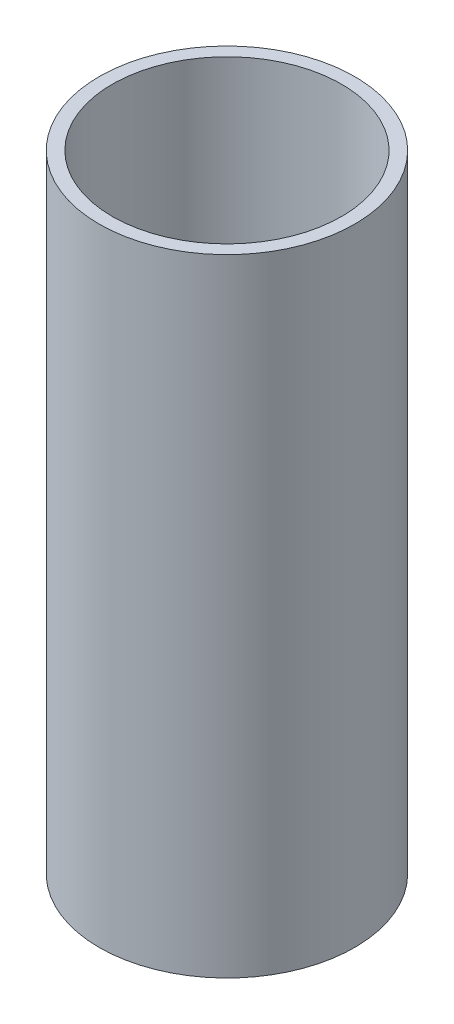
ISO-10303-21;
HEADER;
FILE_DESCRIPTION(('STEP AP214'),'2;1');
FILE_NAME('part.step','',(''),(''),'','','');
FILE_SCHEMA(('AUTOMOTIVE_DESIGN { 1 0 10303 214 1 1 1 1 }'));
ENDSEC;
DATA;
#1=APPLICATION_CONTEXT('core data for automotive mechanical design processes');
#2=APPLICATION_PROTOCOL_DEFINITION('international standard','automotive_design',2000,#1);
#3=PRODUCT_CONTEXT('',#1,'mechanical');
#4=PRODUCT('Part','Part','',(#3));
#5=PRODUCT_RELATED_PRODUCT_CATEGORY('part','',(#4));
#6=PRODUCT_DEFINITION_FORMATION('','',#4);
#7=PRODUCT_DEFINITION_CONTEXT('part definition',#1,'design');
#8=PRODUCT_DEFINITION('design','',#6,#7);
#9=PRODUCT_DEFINITION_SHAPE('','',#8);
#10=(LENGTH_UNIT() NAMED_UNIT(*) SI_UNIT(.MILLI.,.METRE.));
#11=(NAMED_UNIT(*) PLANE_ANGLE_UNIT() SI_UNIT($,.RADIAN.));
#12=(NAMED_UNIT(*) SI_UNIT($,.STERADIAN.) SOLID_ANGLE_UNIT());
#13=UNCERTAINTY_MEASURE_WITH_UNIT(LENGTH_MEASURE(1.E-05),#10,'distance_accuracy_value','');
#14=(GEOMETRIC_REPRESENTATION_CONTEXT(3) GLOBAL_UNCERTAINTY_ASSIGNED_CONTEXT((#13)) GLOBAL_UNIT_ASSIGNED_CONTEXT((#10,
#11,#12)) REPRESENTATION_CONTEXT('',''));
#15=CARTESIAN_POINT('',(0.,0.,0.));
#16=DIRECTION('',(0.,0.,1.));
#17=DIRECTION('',(1.,0.,0.));
#18=AXIS2_PLACEMENT_3D('',#15,#16,#17);
#19=CARTESIAN_POINT('',(0.,196.098768280488,0.));
#20=DIRECTION('',(0.,-1.,0.));
#21=DIRECTION('',(0.,0.,-1.));
#22=AXIS2_PLACEMENT_3D('',#19,#20,#21);
#23=CYLINDRICAL_SURFACE('',#22,40.);
#24=CARTESIAN_POINT('',(0.,196.098768280488,0.));
#25=DIRECTION('',(0.,1.,0.));
#26=DIRECTION('',(0.,0.,1.));
#27=AXIS2_PLACEMENT_3D('',#24,#25,#26);
#28=CIRCLE('',#27,40.);
#29=CARTESIAN_POINT('',(0.,196.098768280488,40.));
#30=VERTEX_POINT('',#29);
#31=EDGE_CURVE('E10',#30,#30,#28,.T.);
#32=ORIENTED_EDGE('',*,*,#31,.F.);
#33=EDGE_LOOP('',(#32));
#34=FACE_BOUND('',#33,.T.);
#35=CARTESIAN_POINT('',(0.,0.,0.));
#36=DIRECTION('',(0.,1.,0.));
#37=DIRECTION('',(0.,0.,1.));
#38=AXIS2_PLACEMENT_3D('',#35,#36,#37);
#39=CIRCLE('',#38,40.);
#40=CARTESIAN_POINT('',(0.,0.,40.));
#41=VERTEX_POINT('',#40);
#42=EDGE_CURVE('E37',#41,#41,#39,.T.);
#43=ORIENTED_EDGE('',*,*,#42,.T.);
#44=EDGE_LOOP('',(#43));
#45=FACE_BOUND('',#44,.T.);
#46=ADVANCED_FACE('F40',(#34,#45),#23,.T.);
#47=CARTESIAN_POINT('',(0.,196.098768280488,0.));
#48=DIRECTION('',(0.,1.,0.));
#49=DIRECTION('',(0.,0.,1.));
#50=AXIS2_PLACEMENT_3D('',#47,#48,#49);
#51=PLANE('',#50);
#52=CARTESIAN_POINT('',(0.,196.098768280488,0.));
#53=DIRECTION('',(0.,1.,0.));
#54=DIRECTION('',(0.,0.,1.));
#55=AXIS2_PLACEMENT_3D('',#52,#53,#54);
#56=CIRCLE('',#55,35.885008553083);
#57=CARTESIAN_POINT('',(0.,196.098768280488,35.885008553083));
#58=VERTEX_POINT('',#57);
#59=EDGE_CURVE('E50',#58,#58,#56,.T.);
#60=ORIENTED_EDGE('',*,*,#59,.F.);
#61=EDGE_LOOP('',(#60));
#62=FACE_BOUND('',#61,.T.);
#63=ORIENTED_EDGE('',*,*,#31,.T.);
#64=EDGE_LOOP('',(#63));
#65=FACE_BOUND('',#64,.T.);
#66=ADVANCED_FACE('F59',(#62,#65),#51,.T.);
#67=CARTESIAN_POINT('',(0.,0.,0.));
#68=DIRECTION('',(0.,1.,0.));
#69=DIRECTION('',(0.,0.,1.));
#70=AXIS2_PLACEMENT_3D('',#67,#68,#69);
#71=PLANE('',#70);
#72=CARTESIAN_POINT('',(0.,0.,0.));
#73=DIRECTION('',(0.,1.,0.));
#74=DIRECTION('',(0.,0.,1.));
#75=AXIS2_PLACEMENT_3D('',#72,#73,#74);
#76=CIRCLE('',#75,35.885008553083);
#77=CARTESIAN_POINT('',(0.,0.,35.885008553083));
#78=VERTEX_POINT('',#77);
#79=EDGE_CURVE('E47',#78,#78,#76,.T.);
#80=ORIENTED_EDGE('',*,*,#79,.T.);
#81=EDGE_LOOP('',(#80));
#82=FACE_BOUND('',#81,.T.);
#83=ORIENTED_EDGE('',*,*,#42,.F.);
#84=EDGE_LOOP('',(#83));
#85=FACE_BOUND('',#84,.T.);
#86=ADVANCED_FACE('F58',(#82,#85),#71,.F.);
#87=CARTESIAN_POINT('',(0.,196.098768280488,0.));
#88=DIRECTION('',(0.,-1.,0.));
#89=DIRECTION('',(0.,0.,-1.));
#90=AXIS2_PLACEMENT_3D('',#87,#88,#89);
#91=CYLINDRICAL_SURFACE('',#90,35.885008553083);
#92=ORIENTED_EDGE('',*,*,#59,.T.);
#93=EDGE_LOOP('',(#92));
#94=FACE_BOUND('',#93,.T.);
#95=ORIENTED_EDGE('',*,*,#79,.F.);
#96=EDGE_LOOP('',(#95));
#97=FACE_BOUND('',#96,.T.);
#98=ADVANCED_FACE('F54',(#94,#97),#91,.F.);
#99=CLOSED_SHELL('',(#46,#66,#86,#98));
#100=MANIFOLD_SOLID_BREP('B2',#99);
#101=ADVANCED_BREP_SHAPE_REPRESENTATION('',(#18,#100),#14);
#102=SHAPE_DEFINITION_REPRESENTATION(#9,#101);
ENDSEC;
END-ISO-10303-21;
